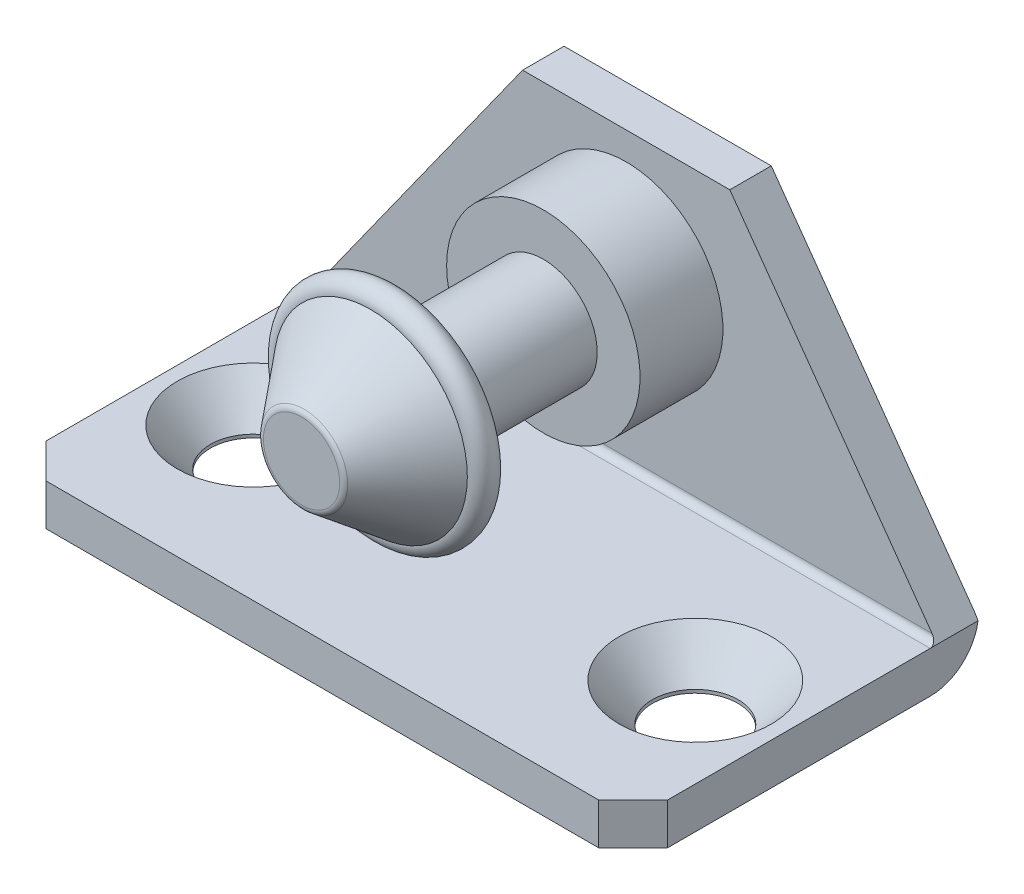
ISO-10303-21;
HEADER;
FILE_DESCRIPTION(('STEP AP214'),'2;1');
FILE_NAME('part.step','',(''),(''),'','','');
FILE_SCHEMA(('AUTOMOTIVE_DESIGN { 1 0 10303 214 1 1 1 1 }'));
ENDSEC;
DATA;
#1=APPLICATION_CONTEXT('core data for automotive mechanical design processes');
#2=APPLICATION_PROTOCOL_DEFINITION('international standard','automotive_design',2000,#1);
#3=PRODUCT_CONTEXT('',#1,'mechanical');
#4=PRODUCT('Part','Part','',(#3));
#5=PRODUCT_RELATED_PRODUCT_CATEGORY('part','',(#4));
#6=PRODUCT_DEFINITION_FORMATION('','',#4);
#7=PRODUCT_DEFINITION_CONTEXT('part definition',#1,'design');
#8=PRODUCT_DEFINITION('design','',#6,#7);
#9=PRODUCT_DEFINITION_SHAPE('','',#8);
#10=(LENGTH_UNIT() NAMED_UNIT(*) SI_UNIT(.MILLI.,.METRE.));
#11=(NAMED_UNIT(*) PLANE_ANGLE_UNIT() SI_UNIT($,.RADIAN.));
#12=(NAMED_UNIT(*) SI_UNIT($,.STERADIAN.) SOLID_ANGLE_UNIT());
#13=UNCERTAINTY_MEASURE_WITH_UNIT(LENGTH_MEASURE(1.E-05),#10,'distance_accuracy_value','');
#14=(GEOMETRIC_REPRESENTATION_CONTEXT(3) GLOBAL_UNCERTAINTY_ASSIGNED_CONTEXT((#13)) GLOBAL_UNIT_ASSIGNED_CONTEXT((#10,
#11,#12)) REPRESENTATION_CONTEXT('',''));
#15=CARTESIAN_POINT('',(0.,0.,0.));
#16=DIRECTION('',(0.,0.,1.));
#17=DIRECTION('',(1.,0.,0.));
#18=AXIS2_PLACEMENT_3D('',#15,#16,#17);
#19=CARTESIAN_POINT('',(0.,15.,20.5));
#20=DIRECTION('',(0.,0.,1.));
#21=DIRECTION('',(1.,0.,0.));
#22=AXIS2_PLACEMENT_3D('',#19,#20,#21);
#23=TOROIDAL_SURFACE('',#22,7.00000000000001,1.);
#24=CARTESIAN_POINT('',(0.,15.,21.5));
#25=DIRECTION('',(0.,0.,1.));
#26=DIRECTION('',(1.,0.,0.));
#27=AXIS2_PLACEMENT_3D('',#24,#25,#26);
#28=CIRCLE('',#27,7.);
#29=CARTESIAN_POINT('',(7.00000000000001,15.,21.5));
#30=VERTEX_POINT('',#29);
#31=EDGE_CURVE('E170',#30,#30,#28,.T.);
#32=ORIENTED_EDGE('',*,*,#31,.F.);
#33=EDGE_LOOP('',(#32));
#34=FACE_BOUND('',#33,.T.);
#35=CARTESIAN_POINT('',(0.,15.,19.5));
#36=DIRECTION('',(0.,0.,1.));
#37=DIRECTION('',(1.,0.,0.));
#38=AXIS2_PLACEMENT_3D('',#35,#36,#37);
#39=CIRCLE('',#38,7.00000000000001);
#40=CARTESIAN_POINT('',(7.00000000000001,15.,19.5));
#41=VERTEX_POINT('',#40);
#42=EDGE_CURVE('E182',#41,#41,#39,.T.);
#43=ORIENTED_EDGE('',*,*,#42,.T.);
#44=EDGE_LOOP('',(#43));
#45=FACE_BOUND('',#44,.T.);
#46=ADVANCED_FACE('F159',(#34,#45),#23,.T.);
#47=CARTESIAN_POINT('',(0.,15.,21.5));
#48=DIRECTION('',(0.,0.,-1.));
#49=DIRECTION('',(-1.,0.,0.));
#50=AXIS2_PLACEMENT_3D('',#47,#48,#49);
#51=CONICAL_SURFACE('',#50,7.,0.674740942223553);
#52=CARTESIAN_POINT('',(0.,15.,26.3123475237772));
#53=DIRECTION('',(0.,0.,1.));
#54=DIRECTION('',(1.,0.,0.));
#55=AXIS2_PLACEMENT_3D('',#52,#53,#54);
#56=CIRCLE('',#55,3.15012198097824);
#57=CARTESIAN_POINT('',(3.15012198097824,15.,26.3123475237772));
#58=VERTEX_POINT('',#57);
#59=EDGE_CURVE('E12',#58,#58,#56,.F.);
#60=ORIENTED_EDGE('',*,*,#59,.T.);
#61=EDGE_LOOP('',(#60));
#62=FACE_BOUND('',#61,.T.);
#63=ORIENTED_EDGE('',*,*,#31,.T.);
#64=EDGE_LOOP('',(#63));
#65=FACE_BOUND('',#64,.T.);
#66=ADVANCED_FACE('F206',(#62,#65),#51,.T.);
#67=CARTESIAN_POINT('',(-3.,15.,26.5));
#68=DIRECTION('',(0.,0.,-1.));
#69=DIRECTION('',(-1.,0.,0.));
#70=AXIS2_PLACEMENT_3D('',#67,#68,#69);
#71=PLANE('',#70);
#72=CARTESIAN_POINT('',(0.,15.,26.5));
#73=DIRECTION('',(0.,0.,-1.));
#74=DIRECTION('',(-1.,0.,0.));
#75=AXIS2_PLACEMENT_3D('',#72,#73,#74);
#76=CIRCLE('',#75,2.75968757625672);
#77=CARTESIAN_POINT('',(-2.75968757625671,15.,26.5));
#78=VERTEX_POINT('',#77);
#79=EDGE_CURVE('E166',#78,#78,#76,.F.);
#80=ORIENTED_EDGE('',*,*,#79,.T.);
#81=EDGE_LOOP('',(#80));
#82=FACE_BOUND('',#81,.T.);
#83=ADVANCED_FACE('F201',(#82),#71,.F.);
#84=CARTESIAN_POINT('',(0.,15.,23.85));
#85=DIRECTION('',(0.,0.,1.));
#86=DIRECTION('',(1.,0.,0.));
#87=AXIS2_PLACEMENT_3D('',#84,#85,#86);
#88=PLANE('',#87);
#89=CARTESIAN_POINT('',(0.,15.,23.85));
#90=DIRECTION('',(0.,0.,1.));
#91=DIRECTION('',(1.,0.,0.));
#92=AXIS2_PLACEMENT_3D('',#89,#90,#91);
#93=CIRCLE('',#92,4.125);
#94=CARTESIAN_POINT('',(4.12500000000001,15.,23.85));
#95=VERTEX_POINT('',#94);
#96=EDGE_CURVE('E174',#95,#95,#93,.T.);
#97=ORIENTED_EDGE('',*,*,#96,.F.);
#98=EDGE_LOOP('',(#97));
#99=FACE_BOUND('',#98,.T.);
#100=ADVANCED_FACE('F196',(#99),#88,.F.);
#101=CARTESIAN_POINT('',(0.,15.,19.5));
#102=DIRECTION('',(0.,0.,1.));
#103=DIRECTION('',(1.,0.,0.));
#104=AXIS2_PLACEMENT_3D('',#101,#102,#103);
#105=CYLINDRICAL_SURFACE('',#104,4.125);
#106=CARTESIAN_POINT('',(0.,15.,19.5));
#107=DIRECTION('',(0.,0.,1.));
#108=DIRECTION('',(1.,0.,0.));
#109=AXIS2_PLACEMENT_3D('',#106,#107,#108);
#110=CIRCLE('',#109,4.125);
#111=CARTESIAN_POINT('',(4.125,15.,19.5));
#112=VERTEX_POINT('',#111);
#113=EDGE_CURVE('E179',#112,#112,#110,.T.);
#114=ORIENTED_EDGE('',*,*,#113,.F.);
#115=EDGE_LOOP('',(#114));
#116=FACE_BOUND('',#115,.T.);
#117=ORIENTED_EDGE('',*,*,#96,.T.);
#118=EDGE_LOOP('',(#117));
#119=FACE_BOUND('',#118,.T.);
#120=ADVANCED_FACE('F190',(#116,#119),#105,.F.);
#121=CARTESIAN_POINT('',(-4.12499999999999,15.,19.5));
#122=DIRECTION('',(0.,0.,1.));
#123=DIRECTION('',(1.,0.,0.));
#124=AXIS2_PLACEMENT_3D('',#121,#122,#123);
#125=PLANE('',#124);
#126=ORIENTED_EDGE('',*,*,#42,.F.);
#127=EDGE_LOOP('',(#126));
#128=FACE_BOUND('',#127,.T.);
#129=ORIENTED_EDGE('',*,*,#113,.T.);
#130=EDGE_LOOP('',(#129));
#131=FACE_BOUND('',#130,.T.);
#132=ADVANCED_FACE('F187',(#128,#131),#125,.F.);
#133=CARTESIAN_POINT('',(0.,15.,26.));
#134=DIRECTION('',(0.,0.,-1.));
#135=DIRECTION('',(-1.,0.,0.));
#136=AXIS2_PLACEMENT_3D('',#133,#134,#135);
#137=TOROIDAL_SURFACE('',#136,2.75968757625672,0.5);
#138=ORIENTED_EDGE('',*,*,#59,.F.);
#139=EDGE_LOOP('',(#138));
#140=FACE_BOUND('',#139,.T.);
#141=ORIENTED_EDGE('',*,*,#79,.F.);
#142=EDGE_LOOP('',(#141));
#143=FACE_BOUND('',#142,.T.);
#144=ADVANCED_FACE('F161',(#140,#143),#137,.T.);
#145=CLOSED_SHELL('',(#46,#66,#83,#100,#120,#132,#144));
#146=MANIFOLD_SOLID_BREP('B2',#145);
#147=CARTESIAN_POINT('',(0.,15.,19.5));
#148=DIRECTION('',(0.,0.,1.));
#149=DIRECTION('',(0.,-1.,0.));
#150=AXIS2_PLACEMENT_3D('',#147,#148,#149);
#151=PLANE('',#150);
#152=CARTESIAN_POINT('',(0.,15.,19.5));
#153=DIRECTION('',(0.,0.,1.));
#154=DIRECTION('',(0.,-1.,0.));
#155=AXIS2_PLACEMENT_3D('',#152,#153,#154);
#156=CIRCLE('',#155,3.9);
#157=CARTESIAN_POINT('',(0.,18.9,19.5));
#158=VERTEX_POINT('',#157);
#159=EDGE_CURVE('E746',#158,#158,#156,.T.);
#160=ORIENTED_EDGE('',*,*,#159,.T.);
#161=EDGE_LOOP('',(#160));
#162=FACE_BOUND('',#161,.T.);
#163=CARTESIAN_POINT('',(0.,15.,19.5));
#164=DIRECTION('',(0.,0.,1.));
#165=DIRECTION('',(0.,-1.,0.));
#166=AXIS2_PLACEMENT_3D('',#163,#164,#165);
#167=CIRCLE('',#166,3.);
#168=CARTESIAN_POINT('',(0.,12.,19.5));
#169=VERTEX_POINT('',#168);
#170=EDGE_CURVE('E743',#169,#169,#167,.T.);
#171=ORIENTED_EDGE('',*,*,#170,.F.);
#172=EDGE_LOOP('',(#171));
#173=FACE_BOUND('',#172,.T.);
#174=ADVANCED_FACE('F259',(#162,#173),#151,.T.);
#175=CARTESIAN_POINT('',(0.,15.,9.));
#176=DIRECTION('',(0.,0.,-1.));
#177=DIRECTION('',(-1.,0.,0.));
#178=AXIS2_PLACEMENT_3D('',#175,#176,#177);
#179=PLANE('',#178);
#180=CARTESIAN_POINT('',(0.,15.,9.));
#181=DIRECTION('',(0.,0.,-1.));
#182=DIRECTION('',(-1.,0.,0.));
#183=AXIS2_PLACEMENT_3D('',#180,#181,#182);
#184=CIRCLE('',#183,7.);
#185=CARTESIAN_POINT('',(-7.,15.,9.));
#186=VERTEX_POINT('',#185);
#187=EDGE_CURVE('E753',#186,#186,#184,.T.);
#188=ORIENTED_EDGE('',*,*,#187,.F.);
#189=EDGE_LOOP('',(#188));
#190=FACE_BOUND('',#189,.T.);
#191=CARTESIAN_POINT('',(0.,15.,9.));
#192=DIRECTION('',(0.,0.,-1.));
#193=DIRECTION('',(-1.,0.,0.));
#194=AXIS2_PLACEMENT_3D('',#191,#192,#193);
#195=CIRCLE('',#194,3.9);
#196=CARTESIAN_POINT('',(0.,18.9,9.));
#197=VERTEX_POINT('',#196);
#198=EDGE_CURVE('E462',#197,#197,#195,.F.);
#199=ORIENTED_EDGE('',*,*,#198,.F.);
#200=EDGE_LOOP('',(#199));
#201=FACE_BOUND('',#200,.T.);
#202=ADVANCED_FACE('F486',(#190,#201),#179,.F.);
#203=CARTESIAN_POINT('',(-22.5,3.,25.));
#204=DIRECTION('',(0.,-1.,0.));
#205=DIRECTION('',(0.,0.,-1.));
#206=AXIS2_PLACEMENT_3D('',#203,#204,#205);
#207=PLANE('',#206);
#208=CARTESIAN_POINT('',(16.,3.,14.));
#209=DIRECTION('',(0.,1.,0.));
#210=DIRECTION('',(0.,0.,1.));
#211=AXIS2_PLACEMENT_3D('',#208,#209,#210);
#212=CIRCLE('',#211,5.5);
#213=CARTESIAN_POINT('',(16.,3.,19.5));
#214=VERTEX_POINT('',#213);
#215=EDGE_CURVE('E756',#214,#214,#212,.T.);
#216=ORIENTED_EDGE('',*,*,#215,.F.);
#217=EDGE_LOOP('',(#216));
#218=FACE_BOUND('',#217,.T.);
#219=CARTESIAN_POINT('',(-16.,3.,14.));
#220=DIRECTION('',(0.,1.,0.));
#221=DIRECTION('',(0.,0.,1.));
#222=AXIS2_PLACEMENT_3D('',#219,#220,#221);
#223=CIRCLE('',#222,5.5);
#224=CARTESIAN_POINT('',(-16.,3.,19.5));
#225=VERTEX_POINT('',#224);
#226=EDGE_CURVE('E767',#225,#225,#223,.T.);
#227=ORIENTED_EDGE('',*,*,#226,.F.);
#228=EDGE_LOOP('',(#227));
#229=FACE_BOUND('',#228,.T.);
#230=DIRECTION('',(1.,0.,0.));
#231=VECTOR('',#230,1.);
#232=CARTESIAN_POINT('',(22.5,3.,25.));
#233=LINE('',#232,#231);
#234=CARTESIAN_POINT('',(-20.,3.,25.));
#235=VERTEX_POINT('',#234);
#236=CARTESIAN_POINT('',(20.,3.,25.));
#237=VERTEX_POINT('',#236);
#238=EDGE_CURVE('E384',#235,#237,#233,.T.);
#239=ORIENTED_EDGE('',*,*,#238,.T.);
#240=DIRECTION('',(-0.707106781186549,0.,0.707106781186546));
#241=VECTOR('',#240,1.);
#242=CARTESIAN_POINT('',(22.5,3.,22.5));
#243=LINE('',#242,#241);
#244=CARTESIAN_POINT('',(22.5,3.,22.5));
#245=VERTEX_POINT('',#244);
#246=EDGE_CURVE('E267',#237,#245,#243,.F.);
#247=ORIENTED_EDGE('',*,*,#246,.T.);
#248=DIRECTION('',(0.,0.,-1.));
#249=VECTOR('',#248,1.);
#250=CARTESIAN_POINT('',(22.5,3.,0.));
#251=LINE('',#250,#249);
#252=CARTESIAN_POINT('',(22.5,3.,3.5));
#253=VERTEX_POINT('',#252);
#254=EDGE_CURVE('E386',#245,#253,#251,.T.);
#255=ORIENTED_EDGE('',*,*,#254,.T.);
#256=DIRECTION('',(1.,0.,0.));
#257=VECTOR('',#256,1.);
#258=CARTESIAN_POINT('',(-22.5,3.,3.5));
#259=LINE('',#258,#257);
#260=CARTESIAN_POINT('',(-22.5,3.,3.5));
#261=VERTEX_POINT('',#260);
#262=EDGE_CURVE('E440',#253,#261,#259,.F.);
#263=ORIENTED_EDGE('',*,*,#262,.T.);
#264=DIRECTION('',(0.,0.,1.));
#265=VECTOR('',#264,1.);
#266=CARTESIAN_POINT('',(-22.5,3.,25.));
#267=LINE('',#266,#265);
#268=CARTESIAN_POINT('',(-22.5,3.,22.5));
#269=VERTEX_POINT('',#268);
#270=EDGE_CURVE('E395',#261,#269,#267,.T.);
#271=ORIENTED_EDGE('',*,*,#270,.T.);
#272=DIRECTION('',(-0.707106781186546,0.,-0.707106781186549));
#273=VECTOR('',#272,1.);
#274=CARTESIAN_POINT('',(-20.,3.,25.));
#275=LINE('',#274,#273);
#276=EDGE_CURVE('E409',#269,#235,#275,.F.);
#277=ORIENTED_EDGE('',*,*,#276,.T.);
#278=EDGE_LOOP('',(#239,#247,#255,#263,#271,#277));
#279=FACE_BOUND('',#278,.T.);
#280=ADVANCED_FACE('F413',(#218,#229,#279),#207,.F.);
#281=CARTESIAN_POINT('',(22.5,3.,25.));
#282=DIRECTION('',(0.,0.,-1.));
#283=DIRECTION('',(-1.,0.,0.));
#284=AXIS2_PLACEMENT_3D('',#281,#282,#283);
#285=PLANE('',#284);
#286=DIRECTION('',(1.,0.,0.));
#287=VECTOR('',#286,1.);
#288=CARTESIAN_POINT('',(22.5,0.,25.));
#289=LINE('',#288,#287);
#290=CARTESIAN_POINT('',(-20.,0.,25.));
#291=VERTEX_POINT('',#290);
#292=CARTESIAN_POINT('',(20.,0.,25.));
#293=VERTEX_POINT('',#292);
#294=EDGE_CURVE('E425',#291,#293,#289,.T.);
#295=ORIENTED_EDGE('',*,*,#294,.T.);
#296=DIRECTION('',(0.,1.,0.));
#297=VECTOR('',#296,1.);
#298=CARTESIAN_POINT('',(20.,3.,25.));
#299=LINE('',#298,#297);
#300=EDGE_CURVE('E280',#293,#237,#299,.T.);
#301=ORIENTED_EDGE('',*,*,#300,.T.);
#302=ORIENTED_EDGE('',*,*,#238,.F.);
#303=DIRECTION('',(0.,-1.,0.));
#304=VECTOR('',#303,1.);
#305=CARTESIAN_POINT('',(-20.,3.,25.));
#306=LINE('',#305,#304);
#307=EDGE_CURVE('E405',#235,#291,#306,.T.);
#308=ORIENTED_EDGE('',*,*,#307,.T.);
#309=EDGE_LOOP('',(#295,#301,#302,#308));
#310=FACE_BOUND('',#309,.T.);
#311=ADVANCED_FACE('F428',(#310),#285,.F.);
#312=CARTESIAN_POINT('',(22.5,3.,0.));
#313=DIRECTION('',(-1.,0.,0.));
#314=DIRECTION('',(0.,0.,1.));
#315=AXIS2_PLACEMENT_3D('',#312,#313,#314);
#316=PLANE('',#315);
#317=ORIENTED_EDGE('',*,*,#254,.F.);
#318=DIRECTION('',(0.,-1.,0.));
#319=VECTOR('',#318,1.);
#320=CARTESIAN_POINT('',(22.5,3.,22.5));
#321=LINE('',#320,#319);
#322=CARTESIAN_POINT('',(22.5,0.,22.5));
#323=VERTEX_POINT('',#322);
#324=EDGE_CURVE('E398',#245,#323,#321,.T.);
#325=ORIENTED_EDGE('',*,*,#324,.T.);
#326=DIRECTION('',(0.,0.,-1.));
#327=VECTOR('',#326,1.);
#328=CARTESIAN_POINT('',(22.5,0.,0.));
#329=LINE('',#328,#327);
#330=CARTESIAN_POINT('',(22.5,0.,3.5));
#331=VERTEX_POINT('',#330);
#332=EDGE_CURVE('E427',#323,#331,#329,.T.);
#333=ORIENTED_EDGE('',*,*,#332,.T.);
#334=CARTESIAN_POINT('',(22.5,3.5,3.5));
#335=DIRECTION('',(-1.,0.,0.));
#336=DIRECTION('',(0.,0.,1.));
#337=AXIS2_PLACEMENT_3D('',#334,#335,#336);
#338=CIRCLE('',#337,3.5);
#339=CARTESIAN_POINT('',(22.5,3.,0.0358983848622453));
#340=VERTEX_POINT('',#339);
#341=EDGE_CURVE('E458',#331,#340,#338,.F.);
#342=ORIENTED_EDGE('',*,*,#341,.T.);
#343=DIRECTION('',(0.,0.,-1.));
#344=VECTOR('',#343,1.);
#345=CARTESIAN_POINT('',(22.5,3.,3.));
#346=LINE('',#345,#344);
#347=EDGE_CURVE('E365',#253,#340,#346,.T.);
#348=ORIENTED_EDGE('',*,*,#347,.F.);
#349=EDGE_LOOP('',(#317,#325,#333,#342,#348));
#350=FACE_BOUND('',#349,.T.);
#351=ADVANCED_FACE('F419',(#350),#316,.F.);
#352=CARTESIAN_POINT('',(-22.5,3.,0.));
#353=DIRECTION('',(0.,0.,1.));
#354=DIRECTION('',(1.,0.,0.));
#355=AXIS2_PLACEMENT_3D('',#352,#353,#354);
#356=PLANE('',#355);
#357=DIRECTION('',(-0.581238193719096,0.813733471206735,0.));
#358=VECTOR('',#357,1.);
#359=CARTESIAN_POINT('',(22.5,3.,0.));
#360=LINE('',#359,#358);
#361=CARTESIAN_POINT('',(22.1428571428571,3.5,0.));
#362=VERTEX_POINT('',#361);
#363=CARTESIAN_POINT('',(7.5,24.,0.));
#364=VERTEX_POINT('',#363);
#365=EDGE_CURVE('E362',#362,#364,#360,.T.);
#366=ORIENTED_EDGE('',*,*,#365,.F.);
#367=DIRECTION('',(-1.,0.,0.));
#368=VECTOR('',#367,1.);
#369=CARTESIAN_POINT('',(-22.5,3.5,0.));
#370=LINE('',#369,#368);
#371=CARTESIAN_POINT('',(-22.1428571428571,3.5,0.));
#372=VERTEX_POINT('',#371);
#373=EDGE_CURVE('E448',#362,#372,#370,.T.);
#374=ORIENTED_EDGE('',*,*,#373,.T.);
#375=DIRECTION('',(-0.581238193719096,-0.813733471206735,0.));
#376=VECTOR('',#375,1.);
#377=CARTESIAN_POINT('',(-7.5,24.,0.));
#378=LINE('',#377,#376);
#379=CARTESIAN_POINT('',(-7.5,24.,0.));
#380=VERTEX_POINT('',#379);
#381=EDGE_CURVE('E355',#380,#372,#378,.T.);
#382=ORIENTED_EDGE('',*,*,#381,.F.);
#383=DIRECTION('',(-1.,0.,0.));
#384=VECTOR('',#383,1.);
#385=CARTESIAN_POINT('',(7.5,24.,0.));
#386=LINE('',#385,#384);
#387=EDGE_CURVE('E379',#364,#380,#386,.T.);
#388=ORIENTED_EDGE('',*,*,#387,.F.);
#389=EDGE_LOOP('',(#366,#374,#382,#388));
#390=FACE_BOUND('',#389,.T.);
#391=ADVANCED_FACE('F546',(#390),#356,.F.);
#392=CARTESIAN_POINT('',(-22.5,3.,25.));
#393=DIRECTION('',(1.,0.,0.));
#394=DIRECTION('',(0.,0.,-1.));
#395=AXIS2_PLACEMENT_3D('',#392,#393,#394);
#396=PLANE('',#395);
#397=DIRECTION('',(0.,0.,1.));
#398=VECTOR('',#397,1.);
#399=CARTESIAN_POINT('',(-22.5,0.,25.));
#400=LINE('',#399,#398);
#401=CARTESIAN_POINT('',(-22.5,0.,3.5));
#402=VERTEX_POINT('',#401);
#403=CARTESIAN_POINT('',(-22.5,0.,22.5));
#404=VERTEX_POINT('',#403);
#405=EDGE_CURVE('E387',#402,#404,#400,.T.);
#406=ORIENTED_EDGE('',*,*,#405,.T.);
#407=DIRECTION('',(0.,1.,0.));
#408=VECTOR('',#407,1.);
#409=CARTESIAN_POINT('',(-22.5,3.,22.5));
#410=LINE('',#409,#408);
#411=EDGE_CURVE('E157',#404,#269,#410,.T.);
#412=ORIENTED_EDGE('',*,*,#411,.T.);
#413=ORIENTED_EDGE('',*,*,#270,.F.);
#414=CARTESIAN_POINT('',(-22.5,3.,0.0358983848622457));
#415=VERTEX_POINT('',#414);
#416=EDGE_CURVE('E441',#415,#261,#267,.T.);
#417=ORIENTED_EDGE('',*,*,#416,.F.);
#418=CARTESIAN_POINT('',(-22.5,3.5,3.5));
#419=DIRECTION('',(1.,0.,0.));
#420=DIRECTION('',(0.,0.,-1.));
#421=AXIS2_PLACEMENT_3D('',#418,#419,#420);
#422=CIRCLE('',#421,3.5);
#423=EDGE_CURVE('E454',#415,#402,#422,.F.);
#424=ORIENTED_EDGE('',*,*,#423,.T.);
#425=EDGE_LOOP('',(#406,#412,#413,#417,#424));
#426=FACE_BOUND('',#425,.T.);
#427=ADVANCED_FACE('F542',(#426),#396,.F.);
#428=CARTESIAN_POINT('',(-22.5,0.,25.));
#429=DIRECTION('',(0.,-1.,0.));
#430=DIRECTION('',(0.,0.,-1.));
#431=AXIS2_PLACEMENT_3D('',#428,#429,#430);
#432=PLANE('',#431);
#433=CARTESIAN_POINT('',(16.,0.,14.));
#434=DIRECTION('',(0.,1.,0.));
#435=DIRECTION('',(0.,0.,1.));
#436=AXIS2_PLACEMENT_3D('',#433,#434,#435);
#437=CIRCLE('',#436,3.1);
#438=CARTESIAN_POINT('',(16.,0.,17.1));
#439=VERTEX_POINT('',#438);
#440=EDGE_CURVE('E764',#439,#439,#437,.T.);
#441=ORIENTED_EDGE('',*,*,#440,.T.);
#442=EDGE_LOOP('',(#441));
#443=FACE_BOUND('',#442,.T.);
#444=CARTESIAN_POINT('',(-16.,0.,14.));
#445=DIRECTION('',(0.,1.,0.));
#446=DIRECTION('',(0.,0.,1.));
#447=AXIS2_PLACEMENT_3D('',#444,#445,#446);
#448=CIRCLE('',#447,3.1);
#449=CARTESIAN_POINT('',(-16.,0.,17.1));
#450=VERTEX_POINT('',#449);
#451=EDGE_CURVE('E376',#450,#450,#448,.T.);
#452=ORIENTED_EDGE('',*,*,#451,.T.);
#453=EDGE_LOOP('',(#452));
#454=FACE_BOUND('',#453,.T.);
#455=ORIENTED_EDGE('',*,*,#332,.F.);
#456=DIRECTION('',(0.707106781186549,0.,-0.707106781186546));
#457=VECTOR('',#456,1.);
#458=CARTESIAN_POINT('',(-1.25000000000012,0.,46.25));
#459=LINE('',#458,#457);
#460=EDGE_CURVE('E403',#323,#293,#459,.F.);
#461=ORIENTED_EDGE('',*,*,#460,.T.);
#462=ORIENTED_EDGE('',*,*,#294,.F.);
#463=DIRECTION('',(0.707106781186546,0.,0.707106781186549));
#464=VECTOR('',#463,1.);
#465=CARTESIAN_POINT('',(-21.25,0.,23.75));
#466=LINE('',#465,#464);
#467=EDGE_CURVE('E401',#291,#404,#466,.F.);
#468=ORIENTED_EDGE('',*,*,#467,.T.);
#469=ORIENTED_EDGE('',*,*,#405,.F.);
#470=DIRECTION('',(-1.,0.,0.));
#471=VECTOR('',#470,1.);
#472=CARTESIAN_POINT('',(22.5,0.,3.5));
#473=LINE('',#472,#471);
#474=EDGE_CURVE('E456',#402,#331,#473,.F.);
#475=ORIENTED_EDGE('',*,*,#474,.T.);
#476=EDGE_LOOP('',(#455,#461,#462,#468,#469,#475));
#477=FACE_BOUND('',#476,.T.);
#478=ADVANCED_FACE('F424',(#443,#454,#477),#432,.T.);
#479=CARTESIAN_POINT('',(22.5,3.,3.));
#480=DIRECTION('',(-0.813733471206735,-0.581238193719096,0.));
#481=DIRECTION('',(0.581238193719096,-0.813733471206735,0.));
#482=AXIS2_PLACEMENT_3D('',#479,#480,#481);
#483=PLANE('',#482);
#484=ORIENTED_EDGE('',*,*,#347,.T.);
#485=CARTESIAN_POINT('',(22.1428571428571,3.5,3.5));
#486=DIRECTION('',(-0.813733471206735,-0.581238193719096,0.));
#487=DIRECTION('',(0.581238193719096,-0.813733471206735,0.));
#488=AXIS2_PLACEMENT_3D('',#485,#486,#487);
#489=ELLIPSE('',#488,4.30116263352131,3.5);
#490=EDGE_CURVE('E460',#340,#362,#489,.F.);
#491=ORIENTED_EDGE('',*,*,#490,.T.);
#492=ORIENTED_EDGE('',*,*,#365,.T.);
#493=DIRECTION('',(0.,0.,-1.));
#494=VECTOR('',#493,1.);
#495=CARTESIAN_POINT('',(7.5,24.,3.));
#496=LINE('',#495,#494);
#497=CARTESIAN_POINT('',(7.5,24.,3.));
#498=VERTEX_POINT('',#497);
#499=EDGE_CURVE('E358',#498,#364,#496,.T.);
#500=ORIENTED_EDGE('',*,*,#499,.F.);
#501=DIRECTION('',(-0.581238193719096,0.813733471206735,0.));
#502=VECTOR('',#501,1.);
#503=CARTESIAN_POINT('',(22.5,3.,3.));
#504=LINE('',#503,#502);
#505=CARTESIAN_POINT('',(22.1428571428571,3.5,3.));
#506=VERTEX_POINT('',#505);
#507=EDGE_CURVE('E344',#506,#498,#504,.T.);
#508=ORIENTED_EDGE('',*,*,#507,.F.);
#509=CARTESIAN_POINT('',(22.1428571428571,3.5,3.5));
#510=DIRECTION('',(-0.813733471206735,-0.581238193719096,0.));
#511=DIRECTION('',(-0.581238193719096,0.813733471206735,0.));
#512=AXIS2_PLACEMENT_3D('',#509,#510,#511);
#513=ELLIPSE('',#512,0.614451804788759,0.5);
#514=EDGE_CURVE('E444',#506,#253,#513,.T.);
#515=ORIENTED_EDGE('',*,*,#514,.T.);
#516=EDGE_LOOP('',(#484,#491,#492,#500,#508,#515));
#517=FACE_BOUND('',#516,.T.);
#518=ADVANCED_FACE('F360',(#517),#483,.F.);
#519=CARTESIAN_POINT('',(7.5,24.,3.));
#520=DIRECTION('',(0.,-1.,0.));
#521=DIRECTION('',(0.,0.,-1.));
#522=AXIS2_PLACEMENT_3D('',#519,#520,#521);
#523=PLANE('',#522);
#524=ORIENTED_EDGE('',*,*,#387,.T.);
#525=DIRECTION('',(0.,0.,-1.));
#526=VECTOR('',#525,1.);
#527=CARTESIAN_POINT('',(-7.5,24.,3.));
#528=LINE('',#527,#526);
#529=CARTESIAN_POINT('',(-7.5,24.,3.));
#530=VERTEX_POINT('',#529);
#531=EDGE_CURVE('E366',#530,#380,#528,.T.);
#532=ORIENTED_EDGE('',*,*,#531,.F.);
#533=DIRECTION('',(-1.,0.,0.));
#534=VECTOR('',#533,1.);
#535=CARTESIAN_POINT('',(7.5,24.,3.));
#536=LINE('',#535,#534);
#537=EDGE_CURVE('E349',#498,#530,#536,.T.);
#538=ORIENTED_EDGE('',*,*,#537,.F.);
#539=ORIENTED_EDGE('',*,*,#499,.T.);
#540=EDGE_LOOP('',(#524,#532,#538,#539));
#541=FACE_BOUND('',#540,.T.);
#542=ADVANCED_FACE('F368',(#541),#523,.F.);
#543=CARTESIAN_POINT('',(-7.5,24.,3.));
#544=DIRECTION('',(0.813733471206735,-0.581238193719096,0.));
#545=DIRECTION('',(0.581238193719096,0.813733471206735,0.));
#546=AXIS2_PLACEMENT_3D('',#543,#544,#545);
#547=PLANE('',#546);
#548=ORIENTED_EDGE('',*,*,#381,.T.);
#549=CARTESIAN_POINT('',(-22.1428571428571,3.5,3.5));
#550=DIRECTION('',(0.813733471206735,-0.581238193719096,0.));
#551=DIRECTION('',(0.581238193719096,0.813733471206735,0.));
#552=AXIS2_PLACEMENT_3D('',#549,#550,#551);
#553=ELLIPSE('',#552,4.30116263352131,3.5);
#554=EDGE_CURVE('E451',#372,#415,#553,.F.);
#555=ORIENTED_EDGE('',*,*,#554,.T.);
#556=ORIENTED_EDGE('',*,*,#416,.T.);
#557=CARTESIAN_POINT('',(-22.1428571428571,3.5,3.5));
#558=DIRECTION('',(0.813733471206735,-0.581238193719096,0.));
#559=DIRECTION('',(-0.581238193719096,-0.813733471206735,0.));
#560=AXIS2_PLACEMENT_3D('',#557,#558,#559);
#561=ELLIPSE('',#560,0.614451804788759,0.5);
#562=CARTESIAN_POINT('',(-22.1428571428571,3.5,3.));
#563=VERTEX_POINT('',#562);
#564=EDGE_CURVE('E446',#261,#563,#561,.T.);
#565=ORIENTED_EDGE('',*,*,#564,.T.);
#566=DIRECTION('',(-0.581238193719096,-0.813733471206735,0.));
#567=VECTOR('',#566,1.);
#568=CARTESIAN_POINT('',(-7.5,24.,3.));
#569=LINE('',#568,#567);
#570=EDGE_CURVE('E371',#530,#563,#569,.T.);
#571=ORIENTED_EDGE('',*,*,#570,.F.);
#572=ORIENTED_EDGE('',*,*,#531,.T.);
#573=EDGE_LOOP('',(#548,#555,#556,#565,#571,#572));
#574=FACE_BOUND('',#573,.T.);
#575=ADVANCED_FACE('F528',(#574),#547,.F.);
#576=CARTESIAN_POINT('',(22.5,3.,3.));
#577=DIRECTION('',(0.,0.,-1.));
#578=DIRECTION('',(-1.,0.,0.));
#579=AXIS2_PLACEMENT_3D('',#576,#577,#578);
#580=PLANE('',#579);
#581=CARTESIAN_POINT('',(0.,15.,3.));
#582=DIRECTION('',(0.,0.,-1.));
#583=DIRECTION('',(-1.,0.,0.));
#584=AXIS2_PLACEMENT_3D('',#581,#582,#583);
#585=CIRCLE('',#584,7.);
#586=CARTESIAN_POINT('',(-7.,15.,3.));
#587=VERTEX_POINT('',#586);
#588=EDGE_CURVE('E752',#587,#587,#585,.T.);
#589=ORIENTED_EDGE('',*,*,#588,.T.);
#590=EDGE_LOOP('',(#589));
#591=FACE_BOUND('',#590,.T.);
#592=ORIENTED_EDGE('',*,*,#570,.T.);
#593=DIRECTION('',(1.,0.,0.));
#594=VECTOR('',#593,1.);
#595=CARTESIAN_POINT('',(22.5,3.5,3.));
#596=LINE('',#595,#594);
#597=EDGE_CURVE('E352',#563,#506,#596,.T.);
#598=ORIENTED_EDGE('',*,*,#597,.T.);
#599=ORIENTED_EDGE('',*,*,#507,.T.);
#600=ORIENTED_EDGE('',*,*,#537,.T.);
#601=EDGE_LOOP('',(#592,#598,#599,#600));
#602=FACE_BOUND('',#601,.T.);
#603=ADVANCED_FACE('F347',(#591,#602),#580,.F.);
#604=CARTESIAN_POINT('',(22.5,3.5,3.5));
#605=DIRECTION('',(-1.,0.,0.));
#606=DIRECTION('',(0.,0.,1.));
#607=AXIS2_PLACEMENT_3D('',#604,#605,#606);
#608=CYLINDRICAL_SURFACE('',#607,0.5);
#609=ORIENTED_EDGE('',*,*,#564,.F.);
#610=ORIENTED_EDGE('',*,*,#262,.F.);
#611=ORIENTED_EDGE('',*,*,#514,.F.);
#612=ORIENTED_EDGE('',*,*,#597,.F.);
#613=EDGE_LOOP('',(#609,#610,#611,#612));
#614=FACE_BOUND('',#613,.T.);
#615=ADVANCED_FACE('F527',(#614),#608,.F.);
#616=CARTESIAN_POINT('',(-22.5,3.5,3.5));
#617=DIRECTION('',(1.,0.,0.));
#618=DIRECTION('',(0.,0.,-1.));
#619=AXIS2_PLACEMENT_3D('',#616,#617,#618);
#620=CYLINDRICAL_SURFACE('',#619,3.5);
#621=ORIENTED_EDGE('',*,*,#341,.F.);
#622=ORIENTED_EDGE('',*,*,#474,.F.);
#623=ORIENTED_EDGE('',*,*,#423,.F.);
#624=ORIENTED_EDGE('',*,*,#554,.F.);
#625=ORIENTED_EDGE('',*,*,#373,.F.);
#626=ORIENTED_EDGE('',*,*,#490,.F.);
#627=EDGE_LOOP('',(#621,#622,#623,#624,#625,#626));
#628=FACE_BOUND('',#627,.T.);
#629=ADVANCED_FACE('F523',(#628),#620,.T.);
#630=CARTESIAN_POINT('',(-16.,3.,14.));
#631=DIRECTION('',(0.,1.,0.));
#632=DIRECTION('',(0.,0.,1.));
#633=AXIS2_PLACEMENT_3D('',#630,#631,#632);
#634=CYLINDRICAL_SURFACE('',#633,3.1);
#635=ORIENTED_EDGE('',*,*,#451,.F.);
#636=EDGE_LOOP('',(#635));
#637=FACE_BOUND('',#636,.T.);
#638=CARTESIAN_POINT('',(-16.,0.239115822669588,14.));
#639=DIRECTION('',(0.,1.,0.));
#640=DIRECTION('',(0.,0.,1.));
#641=AXIS2_PLACEMENT_3D('',#638,#639,#640);
#642=CIRCLE('',#641,3.1);
#643=CARTESIAN_POINT('',(-16.,0.239115822669588,17.1));
#644=VERTEX_POINT('',#643);
#645=EDGE_CURVE('E769',#644,#644,#642,.T.);
#646=ORIENTED_EDGE('',*,*,#645,.T.);
#647=EDGE_LOOP('',(#646));
#648=FACE_BOUND('',#647,.T.);
#649=ADVANCED_FACE('F519',(#637,#648),#634,.F.);
#650=CARTESIAN_POINT('',(-16.,3.,14.));
#651=DIRECTION('',(0.,1.,0.));
#652=DIRECTION('',(0.,0.,1.));
#653=AXIS2_PLACEMENT_3D('',#650,#651,#652);
#654=CONICAL_SURFACE('',#653,5.5,0.715584993317677);
#655=ORIENTED_EDGE('',*,*,#645,.F.);
#656=EDGE_LOOP('',(#655));
#657=FACE_BOUND('',#656,.T.);
#658=ORIENTED_EDGE('',*,*,#226,.T.);
#659=EDGE_LOOP('',(#658));
#660=FACE_BOUND('',#659,.T.);
#661=ADVANCED_FACE('F515',(#657,#660),#654,.F.);
#662=CARTESIAN_POINT('',(16.,3.,14.));
#663=DIRECTION('',(0.,1.,0.));
#664=DIRECTION('',(0.,0.,1.));
#665=AXIS2_PLACEMENT_3D('',#662,#663,#664);
#666=CYLINDRICAL_SURFACE('',#665,3.1);
#667=ORIENTED_EDGE('',*,*,#440,.F.);
#668=EDGE_LOOP('',(#667));
#669=FACE_BOUND('',#668,.T.);
#670=CARTESIAN_POINT('',(16.,0.239115822669588,14.));
#671=DIRECTION('',(0.,1.,0.));
#672=DIRECTION('',(0.,0.,1.));
#673=AXIS2_PLACEMENT_3D('',#670,#671,#672);
#674=CIRCLE('',#673,3.1);
#675=CARTESIAN_POINT('',(16.,0.239115822669588,17.1));
#676=VERTEX_POINT('',#675);
#677=EDGE_CURVE('E761',#676,#676,#674,.T.);
#678=ORIENTED_EDGE('',*,*,#677,.T.);
#679=EDGE_LOOP('',(#678));
#680=FACE_BOUND('',#679,.T.);
#681=ADVANCED_FACE('F511',(#669,#680),#666,.F.);
#682=CARTESIAN_POINT('',(16.,3.,14.));
#683=DIRECTION('',(0.,1.,0.));
#684=DIRECTION('',(0.,0.,1.));
#685=AXIS2_PLACEMENT_3D('',#682,#683,#684);
#686=CONICAL_SURFACE('',#685,5.5,0.715584993317677);
#687=ORIENTED_EDGE('',*,*,#677,.F.);
#688=EDGE_LOOP('',(#687));
#689=FACE_BOUND('',#688,.T.);
#690=ORIENTED_EDGE('',*,*,#215,.T.);
#691=EDGE_LOOP('',(#690));
#692=FACE_BOUND('',#691,.T.);
#693=ADVANCED_FACE('F507',(#689,#692),#686,.F.);
#694=CARTESIAN_POINT('',(0.,15.,9.));
#695=DIRECTION('',(0.,0.,-1.));
#696=DIRECTION('',(-1.,0.,0.));
#697=AXIS2_PLACEMENT_3D('',#694,#695,#696);
#698=CYLINDRICAL_SURFACE('',#697,7.);
#699=ORIENTED_EDGE('',*,*,#187,.T.);
#700=EDGE_LOOP('',(#699));
#701=FACE_BOUND('',#700,.T.);
#702=ORIENTED_EDGE('',*,*,#588,.F.);
#703=EDGE_LOOP('',(#702));
#704=FACE_BOUND('',#703,.T.);
#705=ADVANCED_FACE('F502',(#701,#704),#698,.T.);
#706=CARTESIAN_POINT('',(0.,15.,19.5));
#707=DIRECTION('',(0.,0.,-1.));
#708=DIRECTION('',(0.,1.,0.));
#709=AXIS2_PLACEMENT_3D('',#706,#707,#708);
#710=CYLINDRICAL_SURFACE('',#709,3.9);
#711=CARTESIAN_POINT('',(0.,18.9,19.5));
#712=CARTESIAN_POINT('',(0.,18.9,19.390625));
#713=CARTESIAN_POINT('',(0.,18.9,19.28125));
#714=CARTESIAN_POINT('',(0.,18.9,19.0625));
#715=CARTESIAN_POINT('',(0.,18.9,18.953125));
#716=CARTESIAN_POINT('',(0.,18.9,18.734375));
#717=CARTESIAN_POINT('',(0.,18.9,18.625));
#718=CARTESIAN_POINT('',(0.,18.9,18.40625));
#719=CARTESIAN_POINT('',(0.,18.9,18.296875));
#720=CARTESIAN_POINT('',(0.,18.9,18.078125));
#721=CARTESIAN_POINT('',(0.,18.9,17.96875));
#722=CARTESIAN_POINT('',(0.,18.9,17.75));
#723=CARTESIAN_POINT('',(0.,18.9,17.640625));
#724=CARTESIAN_POINT('',(0.,18.9,17.421875));
#725=CARTESIAN_POINT('',(0.,18.9,17.3125));
#726=CARTESIAN_POINT('',(0.,18.9,17.09375));
#727=CARTESIAN_POINT('',(0.,18.9,16.984375));
#728=CARTESIAN_POINT('',(0.,18.9,16.765625));
#729=CARTESIAN_POINT('',(0.,18.9,16.65625));
#730=CARTESIAN_POINT('',(0.,18.9,16.4375));
#731=CARTESIAN_POINT('',(0.,18.9,16.328125));
#732=CARTESIAN_POINT('',(0.,18.9,16.109375));
#733=CARTESIAN_POINT('',(0.,18.9,16.));
#734=CARTESIAN_POINT('',(0.,18.9,15.78125));
#735=CARTESIAN_POINT('',(0.,18.9,15.671875));
#736=CARTESIAN_POINT('',(0.,18.9,15.453125));
#737=CARTESIAN_POINT('',(0.,18.9,15.34375));
#738=CARTESIAN_POINT('',(0.,18.9,15.125));
#739=CARTESIAN_POINT('',(0.,18.9,15.015625));
#740=CARTESIAN_POINT('',(0.,18.9,14.796875));
#741=CARTESIAN_POINT('',(0.,18.9,14.6875));
#742=CARTESIAN_POINT('',(0.,18.9,14.46875));
#743=CARTESIAN_POINT('',(0.,18.9,14.359375));
#744=CARTESIAN_POINT('',(0.,18.9,14.140625));
#745=CARTESIAN_POINT('',(0.,18.9,14.03125));
#746=CARTESIAN_POINT('',(0.,18.9,13.8125));
#747=CARTESIAN_POINT('',(0.,18.9,13.703125));
#748=CARTESIAN_POINT('',(0.,18.9,13.484375));
#749=CARTESIAN_POINT('',(0.,18.9,13.375));
#750=CARTESIAN_POINT('',(0.,18.9,13.15625));
#751=CARTESIAN_POINT('',(0.,18.9,13.046875));
#752=CARTESIAN_POINT('',(0.,18.9,12.828125));
#753=CARTESIAN_POINT('',(0.,18.9,12.71875));
#754=CARTESIAN_POINT('',(0.,18.9,12.5));
#755=CARTESIAN_POINT('',(0.,18.9,12.390625));
#756=CARTESIAN_POINT('',(0.,18.9,12.171875));
#757=CARTESIAN_POINT('',(0.,18.9,12.0625));
#758=CARTESIAN_POINT('',(0.,18.9,11.84375));
#759=CARTESIAN_POINT('',(0.,18.9,11.734375));
#760=CARTESIAN_POINT('',(0.,18.9,11.515625));
#761=CARTESIAN_POINT('',(0.,18.9,11.40625));
#762=CARTESIAN_POINT('',(0.,18.9,11.1875));
#763=CARTESIAN_POINT('',(0.,18.9,11.078125));
#764=CARTESIAN_POINT('',(0.,18.9,10.859375));
#765=CARTESIAN_POINT('',(0.,18.9,10.75));
#766=CARTESIAN_POINT('',(0.,18.9,10.53125));
#767=CARTESIAN_POINT('',(0.,18.9,10.421875));
#768=CARTESIAN_POINT('',(0.,18.9,10.203125));
#769=CARTESIAN_POINT('',(0.,18.9,10.09375));
#770=CARTESIAN_POINT('',(0.,18.9,9.875));
#771=CARTESIAN_POINT('',(0.,18.9,9.765625));
#772=CARTESIAN_POINT('',(0.,18.9,9.546875));
#773=CARTESIAN_POINT('',(0.,18.9,9.4375));
#774=CARTESIAN_POINT('',(0.,18.9,9.21875));
#775=CARTESIAN_POINT('',(0.,18.9,9.109375));
#776=CARTESIAN_POINT('',(0.,18.9,9.));
#777=B_SPLINE_CURVE_WITH_KNOTS('',3,(#711,#712,#713,#714,#715,#716,#717,#718,#719,#720,#721,
#722,#723,#724,#725,#726,#727,#728,#729,#730,#731,#732,#733,#734,#735,#736,#737,#738,#739,#740,
#741,#742,#743,#744,#745,#746,#747,#748,#749,#750,#751,#752,#753,#754,#755,#756,#757,#758,#759,
#760,#761,#762,#763,#764,#765,#766,#767,#768,#769,#770,#771,#772,#773,#774,#775,#776),
.UNSPECIFIED.,.F.,.F.,(4,2,2,2,2,2,2,2,2,2,2,2,2,2,2,2,2,2,2,2,2,2,2,2,2,2,2,2,2,2,2,2,4),(0.,
0.328124999999999,0.656249999999997,0.984374999999999,1.3125,1.640625,1.96875,2.296875,2.625,
2.953125,3.28125,3.609375,3.9375,4.26562499999999,4.59375,4.921875,5.25,5.578125,
5.90624999999999,6.234375,6.5625,6.890625,7.21875,7.54687499999999,7.87499999999999,
8.20312499999999,8.53124999999999,8.85937499999999,9.18749999999999,9.51562499999999,
9.84374999999999,10.171875,10.5),.UNSPECIFIED.);
#778=EDGE_CURVE('BSEAM500',#158,#197,#777,.T.);
#779=ORIENTED_EDGE('',*,*,#159,.F.);
#780=ORIENTED_EDGE('',*,*,#198,.T.);
#781=ORIENTED_EDGE('',*,*,#778,.T.);
#782=ORIENTED_EDGE('',*,*,#778,.F.);
#783=EDGE_LOOP('',(#779,#781,#780,#782));
#784=FACE_BOUND('',#783,.T.);
#785=ADVANCED_FACE('F500',(#784),#710,.T.);
#786=CARTESIAN_POINT('',(0.,15.,20.9));
#787=DIRECTION('',(0.,0.,-1.));
#788=DIRECTION('',(0.,1.,0.));
#789=AXIS2_PLACEMENT_3D('',#786,#787,#788);
#790=CYLINDRICAL_SURFACE('',#789,3.);
#791=CARTESIAN_POINT('',(0.,15.,20.9));
#792=DIRECTION('',(0.,0.,1.));
#793=DIRECTION('',(0.,-1.,0.));
#794=AXIS2_PLACEMENT_3D('',#791,#792,#793);
#795=CIRCLE('',#794,3.);
#796=CARTESIAN_POINT('',(0.,12.,20.9));
#797=VERTEX_POINT('',#796);
#798=EDGE_CURVE('E740',#797,#797,#795,.T.);
#799=ORIENTED_EDGE('',*,*,#798,.F.);
#800=EDGE_LOOP('',(#799));
#801=FACE_BOUND('',#800,.T.);
#802=ORIENTED_EDGE('',*,*,#170,.T.);
#803=EDGE_LOOP('',(#802));
#804=FACE_BOUND('',#803,.T.);
#805=ADVANCED_FACE('F498',(#801,#804),#790,.T.);
#806=CARTESIAN_POINT('',(0.,15.,20.9));
#807=DIRECTION('',(0.,0.,1.));
#808=DIRECTION('',(0.,-1.,0.));
#809=AXIS2_PLACEMENT_3D('',#806,#807,#808);
#810=PLANE('',#809);
#811=CARTESIAN_POINT('',(0.,15.,20.9));
#812=DIRECTION('',(0.,0.,1.));
#813=DIRECTION('',(0.,-1.,0.));
#814=AXIS2_PLACEMENT_3D('',#811,#812,#813);
#815=CIRCLE('',#814,3.9);
#816=CARTESIAN_POINT('',(0.,18.9,20.9));
#817=VERTEX_POINT('',#816);
#818=EDGE_CURVE('E744',#817,#817,#815,.T.);
#819=ORIENTED_EDGE('',*,*,#818,.F.);
#820=EDGE_LOOP('',(#819));
#821=FACE_BOUND('',#820,.T.);
#822=ORIENTED_EDGE('',*,*,#798,.T.);
#823=EDGE_LOOP('',(#822));
#824=FACE_BOUND('',#823,.T.);
#825=ADVANCED_FACE('F630',(#821,#824),#810,.F.);
#826=CARTESIAN_POINT('',(0.,15.,24.));
#827=DIRECTION('',(0.,0.,-1.));
#828=DIRECTION('',(0.,1.,0.));
#829=AXIS2_PLACEMENT_3D('',#826,#827,#828);
#830=CYLINDRICAL_SURFACE('',#829,3.9);
#831=CARTESIAN_POINT('',(0.,15.,23.));
#832=DIRECTION('',(0.,0.,1.));
#833=DIRECTION('',(1.,0.,0.));
#834=AXIS2_PLACEMENT_3D('',#831,#832,#833);
#835=CIRCLE('',#834,3.9);
#836=CARTESIAN_POINT('',(0.,18.9,23.));
#837=VERTEX_POINT('',#836);
#838=EDGE_CURVE('E396',#837,#837,#835,.F.);
#839=CARTESIAN_POINT('',(0.,18.9,23.));
#840=CARTESIAN_POINT('',(0.,18.9,22.978125));
#841=CARTESIAN_POINT('',(0.,18.9,22.95625));
#842=CARTESIAN_POINT('',(0.,18.9,22.9125));
#843=CARTESIAN_POINT('',(0.,18.9,22.890625));
#844=CARTESIAN_POINT('',(0.,18.9,22.846875));
#845=CARTESIAN_POINT('',(0.,18.9,22.825));
#846=CARTESIAN_POINT('',(0.,18.9,22.78125));
#847=CARTESIAN_POINT('',(0.,18.9,22.759375));
#848=CARTESIAN_POINT('',(0.,18.9,22.715625));
#849=CARTESIAN_POINT('',(0.,18.9,22.69375));
#850=CARTESIAN_POINT('',(0.,18.9,22.65));
#851=CARTESIAN_POINT('',(0.,18.9,22.628125));
#852=CARTESIAN_POINT('',(0.,18.9,22.584375));
#853=CARTESIAN_POINT('',(0.,18.9,22.5625));
#854=CARTESIAN_POINT('',(0.,18.9,22.51875));
#855=CARTESIAN_POINT('',(0.,18.9,22.496875));
#856=CARTESIAN_POINT('',(0.,18.9,22.453125));
#857=CARTESIAN_POINT('',(0.,18.9,22.43125));
#858=CARTESIAN_POINT('',(0.,18.9,22.3875));
#859=CARTESIAN_POINT('',(0.,18.9,22.365625));
#860=CARTESIAN_POINT('',(0.,18.9,22.321875));
#861=CARTESIAN_POINT('',(0.,18.9,22.3));
#862=CARTESIAN_POINT('',(0.,18.9,22.25625));
#863=CARTESIAN_POINT('',(0.,18.9,22.234375));
#864=CARTESIAN_POINT('',(0.,18.9,22.190625));
#865=CARTESIAN_POINT('',(0.,18.9,22.16875));
#866=CARTESIAN_POINT('',(0.,18.9,22.125));
#867=CARTESIAN_POINT('',(0.,18.9,22.103125));
#868=CARTESIAN_POINT('',(0.,18.9,22.059375));
#869=CARTESIAN_POINT('',(0.,18.9,22.0375));
#870=CARTESIAN_POINT('',(0.,18.9,21.99375));
#871=CARTESIAN_POINT('',(0.,18.9,21.971875));
#872=CARTESIAN_POINT('',(0.,18.9,21.928125));
#873=CARTESIAN_POINT('',(0.,18.9,21.90625));
#874=CARTESIAN_POINT('',(0.,18.9,21.8625));
#875=CARTESIAN_POINT('',(0.,18.9,21.840625));
#876=CARTESIAN_POINT('',(0.,18.9,21.796875));
#877=CARTESIAN_POINT('',(0.,18.9,21.775));
#878=CARTESIAN_POINT('',(0.,18.9,21.73125));
#879=CARTESIAN_POINT('',(0.,18.9,21.709375));
#880=CARTESIAN_POINT('',(0.,18.9,21.665625));
#881=CARTESIAN_POINT('',(0.,18.9,21.64375));
#882=CARTESIAN_POINT('',(0.,18.9,21.6));
#883=CARTESIAN_POINT('',(0.,18.9,21.578125));
#884=CARTESIAN_POINT('',(0.,18.9,21.534375));
#885=CARTESIAN_POINT('',(0.,18.9,21.5125));
#886=CARTESIAN_POINT('',(0.,18.9,21.46875));
#887=CARTESIAN_POINT('',(0.,18.9,21.446875));
#888=CARTESIAN_POINT('',(0.,18.9,21.403125));
#889=CARTESIAN_POINT('',(0.,18.9,21.38125));
#890=CARTESIAN_POINT('',(0.,18.9,21.3375));
#891=CARTESIAN_POINT('',(0.,18.9,21.315625));
#892=CARTESIAN_POINT('',(0.,18.9,21.271875));
#893=CARTESIAN_POINT('',(0.,18.9,21.25));
#894=CARTESIAN_POINT('',(0.,18.9,21.20625));
#895=CARTESIAN_POINT('',(0.,18.9,21.184375));
#896=CARTESIAN_POINT('',(0.,18.9,21.140625));
#897=CARTESIAN_POINT('',(0.,18.9,21.11875));
#898=CARTESIAN_POINT('',(0.,18.9,21.075));
#899=CARTESIAN_POINT('',(0.,18.9,21.053125));
#900=CARTESIAN_POINT('',(0.,18.9,21.009375));
#901=CARTESIAN_POINT('',(0.,18.9,20.9875));
#902=CARTESIAN_POINT('',(0.,18.9,20.94375));
#903=CARTESIAN_POINT('',(0.,18.9,20.921875));
#904=CARTESIAN_POINT('',(0.,18.9,20.9));
#905=B_SPLINE_CURVE_WITH_KNOTS('',3,(#839,#840,#841,#842,#843,#844,#845,#846,#847,#848,#849,
#850,#851,#852,#853,#854,#855,#856,#857,#858,#859,#860,#861,#862,#863,#864,#865,#866,#867,#868,
#869,#870,#871,#872,#873,#874,#875,#876,#877,#878,#879,#880,#881,#882,#883,#884,#885,#886,#887,
#888,#889,#890,#891,#892,#893,#894,#895,#896,#897,#898,#899,#900,#901,#902,#903,#904),
.UNSPECIFIED.,.F.,.F.,(4,2,2,2,2,2,2,2,2,2,2,2,2,2,2,2,2,2,2,2,2,2,2,2,2,2,2,2,2,2,2,2,4),(0.,
0.0656250000000032,0.131250000000003,0.196875000000003,0.262500000000006,0.328125000000005,
0.393750000000005,0.459375000000008,0.525000000000008,0.590625000000008,0.656250000000011,
0.721875000000011,0.78750000000001,0.853125000000014,0.918750000000013,0.984375000000013,
1.05000000000001,1.11562500000002,1.18125000000002,1.24687500000002,1.31250000000002,
1.37812500000002,1.44375000000002,1.50937500000002,1.57500000000002,1.64062500000002,
1.70625000000002,1.77187500000002,1.83750000000002,1.90312500000002,1.96875000000003,
2.03437500000003,2.10000000000003),.UNSPECIFIED.);
#906=EDGE_CURVE('BSEAM471',#837,#817,#905,.T.);
#907=ORIENTED_EDGE('',*,*,#838,.T.);
#908=ORIENTED_EDGE('',*,*,#818,.T.);
#909=ORIENTED_EDGE('',*,*,#906,.T.);
#910=ORIENTED_EDGE('',*,*,#906,.F.);
#911=EDGE_LOOP('',(#907,#909,#908,#910));
#912=FACE_BOUND('',#911,.T.);
#913=ADVANCED_FACE('F471',(#912),#830,.T.);
#914=CARTESIAN_POINT('',(0.,15.,24.));
#915=DIRECTION('',(0.,0.,1.));
#916=DIRECTION('',(0.,-1.,0.));
#917=AXIS2_PLACEMENT_3D('',#914,#915,#916);
#918=PLANE('',#917);
#919=CARTESIAN_POINT('',(0.,15.,24.));
#920=DIRECTION('',(0.,0.,1.));
#921=DIRECTION('',(0.,-1.,0.));
#922=AXIS2_PLACEMENT_3D('',#919,#920,#921);
#923=CIRCLE('',#922,2.90000000000003);
#924=CARTESIAN_POINT('',(0.,12.1,24.));
#925=VERTEX_POINT('',#924);
#926=EDGE_CURVE('E464',#925,#925,#923,.T.);
#927=ORIENTED_EDGE('',*,*,#926,.T.);
#928=EDGE_LOOP('',(#927));
#929=FACE_BOUND('',#928,.T.);
#930=ADVANCED_FACE('F477',(#929),#918,.T.);
#931=CARTESIAN_POINT('',(0.,15.,24.));
#932=DIRECTION('',(0.,0.,-1.));
#933=DIRECTION('',(-1.,0.,0.));
#934=AXIS2_PLACEMENT_3D('',#931,#932,#933);
#935=CONICAL_SURFACE('',#934,2.90000000000003,0.785398163397449);
#936=ORIENTED_EDGE('',*,*,#838,.F.);
#937=EDGE_LOOP('',(#936));
#938=FACE_BOUND('',#937,.T.);
#939=ORIENTED_EDGE('',*,*,#926,.F.);
#940=EDGE_LOOP('',(#939));
#941=FACE_BOUND('',#940,.T.);
#942=ADVANCED_FACE('F474',(#938,#941),#935,.T.);
#943=CARTESIAN_POINT('',(22.5,3.,22.5));
#944=DIRECTION('',(-0.707106781186545,0.,-0.707106781186549));
#945=DIRECTION('',(-0.707106781186549,0.,0.707106781186546));
#946=AXIS2_PLACEMENT_3D('',#943,#944,#945);
#947=PLANE('',#946);
#948=ORIENTED_EDGE('',*,*,#246,.F.);
#949=ORIENTED_EDGE('',*,*,#300,.F.);
#950=ORIENTED_EDGE('',*,*,#460,.F.);
#951=ORIENTED_EDGE('',*,*,#324,.F.);
#952=EDGE_LOOP('',(#948,#949,#950,#951));
#953=FACE_BOUND('',#952,.T.);
#954=ADVANCED_FACE('F421',(#953),#947,.F.);
#955=CARTESIAN_POINT('',(-20.,3.,25.));
#956=DIRECTION('',(0.707106781186549,0.,-0.707106781186545));
#957=DIRECTION('',(-0.707106781186546,0.,-0.707106781186549));
#958=AXIS2_PLACEMENT_3D('',#955,#956,#957);
#959=PLANE('',#958);
#960=ORIENTED_EDGE('',*,*,#276,.F.);
#961=ORIENTED_EDGE('',*,*,#411,.F.);
#962=ORIENTED_EDGE('',*,*,#467,.F.);
#963=ORIENTED_EDGE('',*,*,#307,.F.);
#964=EDGE_LOOP('',(#960,#961,#962,#963));
#965=FACE_BOUND('',#964,.T.);
#966=ADVANCED_FACE('F261',(#965),#959,.F.);
#967=CLOSED_SHELL('',(#174,#202,#280,#311,#351,#391,#427,#478,#518,#542,#575,#603,#615,#629,
#649,#661,#681,#693,#705,#785,#805,#825,#913,#930,#942,#954,#966));
#968=MANIFOLD_SOLID_BREP('B7',#967);
#969=ADVANCED_BREP_SHAPE_REPRESENTATION('',(#18,#146,#968),#14);
#970=SHAPE_DEFINITION_REPRESENTATION(#9,#969);
ENDSEC;
END-ISO-10303-21;
